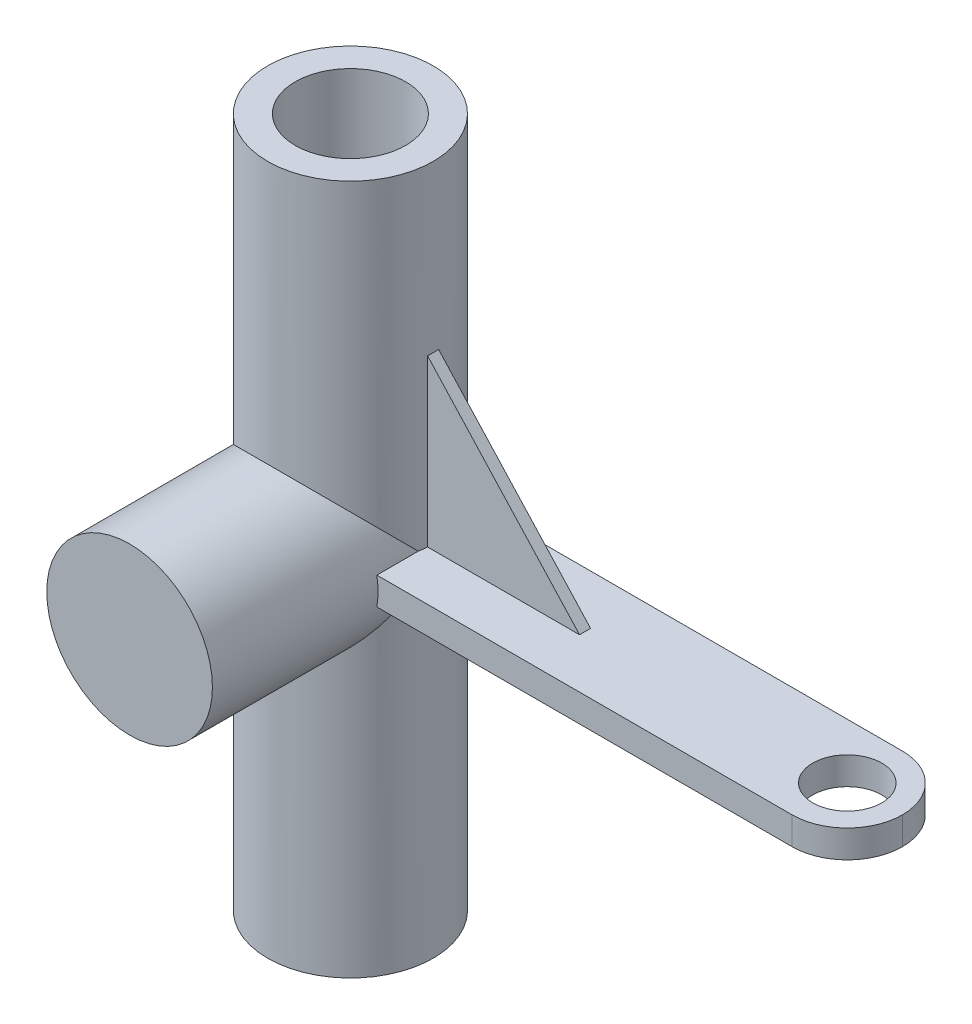
ISO-10303-21;
HEADER;
FILE_DESCRIPTION(('STEP AP214'),'2;1');
FILE_NAME('part.step','',(''),(''),'','','');
FILE_SCHEMA(('AUTOMOTIVE_DESIGN { 1 0 10303 214 1 1 1 1 }'));
ENDSEC;
DATA;
#1=APPLICATION_CONTEXT('core data for automotive mechanical design processes');
#2=APPLICATION_PROTOCOL_DEFINITION('international standard','automotive_design',2000,#1);
#3=PRODUCT_CONTEXT('',#1,'mechanical');
#4=PRODUCT('Part','Part','',(#3));
#5=PRODUCT_RELATED_PRODUCT_CATEGORY('part','',(#4));
#6=PRODUCT_DEFINITION_FORMATION('','',#4);
#7=PRODUCT_DEFINITION_CONTEXT('part definition',#1,'design');
#8=PRODUCT_DEFINITION('design','',#6,#7);
#9=PRODUCT_DEFINITION_SHAPE('','',#8);
#10=(LENGTH_UNIT() NAMED_UNIT(*) SI_UNIT(.MILLI.,.METRE.));
#11=(NAMED_UNIT(*) PLANE_ANGLE_UNIT() SI_UNIT($,.RADIAN.));
#12=(NAMED_UNIT(*) SI_UNIT($,.STERADIAN.) SOLID_ANGLE_UNIT());
#13=UNCERTAINTY_MEASURE_WITH_UNIT(LENGTH_MEASURE(1.E-05),#10,'distance_accuracy_value','');
#14=(GEOMETRIC_REPRESENTATION_CONTEXT(3) GLOBAL_UNCERTAINTY_ASSIGNED_CONTEXT((#13)) GLOBAL_UNIT_ASSIGNED_CONTEXT((#10,
#11,#12)) REPRESENTATION_CONTEXT('',''));
#15=CARTESIAN_POINT('',(0.,0.,0.));
#16=DIRECTION('',(0.,0.,1.));
#17=DIRECTION('',(1.,0.,0.));
#18=AXIS2_PLACEMENT_3D('',#15,#16,#17);
#19=CARTESIAN_POINT('',(0.,125.,0.));
#20=DIRECTION('',(0.,-1.,0.));
#21=DIRECTION('',(0.,0.,-1.));
#22=AXIS2_PLACEMENT_3D('',#19,#20,#21);
#23=CYLINDRICAL_SURFACE('',#22,15.);
#24=CARTESIAN_POINT('',(0.,0.,0.));
#25=DIRECTION('',(0.,1.,0.));
#26=DIRECTION('',(0.,0.,1.));
#27=AXIS2_PLACEMENT_3D('',#24,#25,#26);
#28=CIRCLE('',#27,15.);
#29=CARTESIAN_POINT('',(0.,0.,15.));
#30=VERTEX_POINT('',#29);
#31=EDGE_CURVE('E224',#30,#30,#28,.T.);
#32=ORIENTED_EDGE('',*,*,#31,.T.);
#33=EDGE_LOOP('',(#32));
#34=FACE_BOUND('',#33,.T.);
#35=CARTESIAN_POINT('',(0.,125.,0.));
#36=DIRECTION('',(0.,1.,0.));
#37=DIRECTION('',(0.,0.,1.));
#38=AXIS2_PLACEMENT_3D('',#35,#36,#37);
#39=CIRCLE('',#38,15.);
#40=CARTESIAN_POINT('',(0.,125.,15.));
#41=VERTEX_POINT('',#40);
#42=EDGE_CURVE('E227',#41,#41,#39,.T.);
#43=ORIENTED_EDGE('',*,*,#42,.F.);
#44=EDGE_LOOP('',(#43));
#45=FACE_BOUND('',#44,.T.);
#46=DIRECTION('',(0.,-1.,0.));
#47=VECTOR('',#46,1.);
#48=CARTESIAN_POINT('',(14.9666295470958,125.,-0.999999999999997));
#49=LINE('',#48,#47);
#50=CARTESIAN_POINT('',(14.9666295470958,65.,-0.999999999999997));
#51=VERTEX_POINT('',#50);
#52=CARTESIAN_POINT('',(14.9666295470958,95.,-0.999999999999997));
#53=VERTEX_POINT('',#52);
#54=EDGE_CURVE('E158',#51,#53,#49,.F.);
#55=ORIENTED_EDGE('',*,*,#54,.F.);
#56=CARTESIAN_POINT('',(0.,65.,0.));
#57=DIRECTION('',(0.,-1.,0.));
#58=DIRECTION('',(0.,0.,-1.));
#59=AXIS2_PLACEMENT_3D('',#56,#57,#58);
#60=CIRCLE('',#59,15.);
#61=CARTESIAN_POINT('',(11.180339887499,65.,-10.));
#62=VERTEX_POINT('',#61);
#63=EDGE_CURVE('E164',#62,#51,#60,.T.);
#64=ORIENTED_EDGE('',*,*,#63,.F.);
#65=DIRECTION('',(0.,-1.,0.));
#66=VECTOR('',#65,1.);
#67=CARTESIAN_POINT('',(11.180339887499,125.,-10.));
#68=LINE('',#67,#66);
#69=CARTESIAN_POINT('',(11.180339887499,60.,-10.));
#70=VERTEX_POINT('',#69);
#71=EDGE_CURVE('E205',#70,#62,#68,.F.);
#72=ORIENTED_EDGE('',*,*,#71,.F.);
#73=CARTESIAN_POINT('',(0.,60.,0.));
#74=DIRECTION('',(0.,1.,0.));
#75=DIRECTION('',(0.,0.,1.));
#76=AXIS2_PLACEMENT_3D('',#73,#74,#75);
#77=CIRCLE('',#76,15.);
#78=CARTESIAN_POINT('',(14.7901994577491,60.,2.5));
#79=VERTEX_POINT('',#78);
#80=EDGE_CURVE('E196',#79,#70,#77,.T.);
#81=ORIENTED_EDGE('',*,*,#80,.F.);
#82=CARTESIAN_POINT('',(0.,62.5,0.));
#83=DIRECTION('',(0.,-0.707106781186547,-0.707106781186547));
#84=DIRECTION('',(0.,-0.707106781186547,0.707106781186547));
#85=AXIS2_PLACEMENT_3D('',#82,#83,#84);
#86=ELLIPSE('',#85,21.2132034355964,15.);
#87=CARTESIAN_POINT('',(-15.,62.5,0.));
#88=VERTEX_POINT('',#87);
#89=EDGE_CURVE('E217',#88,#79,#86,.F.);
#90=ORIENTED_EDGE('',*,*,#89,.F.);
#91=CARTESIAN_POINT('',(0.,62.5,0.));
#92=DIRECTION('',(0.,-0.707106781186547,0.707106781186547));
#93=DIRECTION('',(0.,-0.707106781186547,-0.707106781186547));
#94=AXIS2_PLACEMENT_3D('',#91,#92,#93);
#95=ELLIPSE('',#94,21.2132034355964,15.);
#96=CARTESIAN_POINT('',(14.7901994577491,65.,2.5));
#97=VERTEX_POINT('',#96);
#98=EDGE_CURVE('E212',#97,#88,#95,.T.);
#99=ORIENTED_EDGE('',*,*,#98,.F.);
#100=CARTESIAN_POINT('',(14.9666295470958,65.,1.));
#101=VERTEX_POINT('',#100);
#102=EDGE_CURVE('E189',#101,#97,#60,.T.);
#103=ORIENTED_EDGE('',*,*,#102,.F.);
#104=DIRECTION('',(0.,-1.,0.));
#105=VECTOR('',#104,1.);
#106=CARTESIAN_POINT('',(14.9666295470958,125.,1.));
#107=LINE('',#106,#105);
#108=CARTESIAN_POINT('',(14.9666295470958,95.,1.));
#109=VERTEX_POINT('',#108);
#110=EDGE_CURVE('E151',#109,#101,#107,.T.);
#111=ORIENTED_EDGE('',*,*,#110,.F.);
#112=CARTESIAN_POINT('',(0.,95.,0.));
#113=DIRECTION('',(0.,-1.,0.));
#114=DIRECTION('',(0.,0.,-1.));
#115=AXIS2_PLACEMENT_3D('',#112,#113,#114);
#116=CIRCLE('',#115,15.);
#117=EDGE_CURVE('E11',#53,#109,#116,.T.);
#118=ORIENTED_EDGE('',*,*,#117,.F.);
#119=EDGE_LOOP('',(#55,#64,#72,#81,#90,#99,#103,#111,#118));
#120=FACE_BOUND('',#119,.T.);
#121=ADVANCED_FACE('F43',(#34,#45,#120),#23,.T.);
#122=CARTESIAN_POINT('',(100.,65.,10.));
#123=DIRECTION('',(0.,-1.,0.));
#124=DIRECTION('',(0.,0.,-1.));
#125=AXIS2_PLACEMENT_3D('',#122,#123,#124);
#126=PLANE('',#125);
#127=CARTESIAN_POINT('',(90.,65.,0.));
#128=DIRECTION('',(0.,1.,0.));
#129=DIRECTION('',(0.,0.,1.));
#130=AXIS2_PLACEMENT_3D('',#127,#128,#129);
#131=CIRCLE('',#130,6.25);
#132=CARTESIAN_POINT('',(90.,65.,6.25));
#133=VERTEX_POINT('',#132);
#134=EDGE_CURVE('E580',#133,#133,#131,.T.);
#135=ORIENTED_EDGE('',*,*,#134,.F.);
#136=EDGE_LOOP('',(#135));
#137=FACE_BOUND('',#136,.T.);
#138=DIRECTION('',(0.,0.,-1.));
#139=VECTOR('',#138,1.);
#140=CARTESIAN_POINT('',(42.5,65.,-0.999999999999997));
#141=LINE('',#140,#139);
#142=CARTESIAN_POINT('',(42.5,65.,1.));
#143=VERTEX_POINT('',#142);
#144=CARTESIAN_POINT('',(42.5,65.,-0.999999999999997));
#145=VERTEX_POINT('',#144);
#146=EDGE_CURVE('E145',#143,#145,#141,.T.);
#147=ORIENTED_EDGE('',*,*,#146,.F.);
#148=DIRECTION('',(1.,0.,0.));
#149=VECTOR('',#148,1.);
#150=CARTESIAN_POINT('',(100.,65.,1.));
#151=LINE('',#150,#149);
#152=EDGE_CURVE('E52',#101,#143,#151,.T.);
#153=ORIENTED_EDGE('',*,*,#152,.F.);
#154=ORIENTED_EDGE('',*,*,#102,.T.);
#155=DIRECTION('',(0.,0.,-1.));
#156=VECTOR('',#155,1.);
#157=CARTESIAN_POINT('',(14.7901994577491,65.,40.));
#158=LINE('',#157,#156);
#159=CARTESIAN_POINT('',(14.7901994577491,65.,10.));
#160=VERTEX_POINT('',#159);
#161=EDGE_CURVE('E355',#97,#160,#158,.F.);
#162=ORIENTED_EDGE('',*,*,#161,.T.);
#163=DIRECTION('',(-1.,0.,0.));
#164=VECTOR('',#163,1.);
#165=CARTESIAN_POINT('',(100.,65.,10.));
#166=LINE('',#165,#164);
#167=CARTESIAN_POINT('',(90.,65.,10.));
#168=VERTEX_POINT('',#167);
#169=EDGE_CURVE('E181',#168,#160,#166,.T.);
#170=ORIENTED_EDGE('',*,*,#169,.F.);
#171=CARTESIAN_POINT('',(90.,65.,0.));
#172=DIRECTION('',(0.,-1.,0.));
#173=DIRECTION('',(0.,0.,-1.));
#174=AXIS2_PLACEMENT_3D('',#171,#172,#173);
#175=CIRCLE('',#174,10.);
#176=CARTESIAN_POINT('',(100.,65.,0.));
#177=VERTEX_POINT('',#176);
#178=EDGE_CURVE('E363',#168,#177,#175,.F.);
#179=ORIENTED_EDGE('',*,*,#178,.T.);
#180=CARTESIAN_POINT('',(90.,65.,0.));
#181=DIRECTION('',(0.,-1.,0.));
#182=DIRECTION('',(0.,0.,-1.));
#183=AXIS2_PLACEMENT_3D('',#180,#181,#182);
#184=CIRCLE('',#183,10.);
#185=CARTESIAN_POINT('',(90.,65.,-10.));
#186=VERTEX_POINT('',#185);
#187=EDGE_CURVE('E342',#177,#186,#184,.F.);
#188=ORIENTED_EDGE('',*,*,#187,.T.);
#189=DIRECTION('',(-1.,0.,0.));
#190=VECTOR('',#189,1.);
#191=CARTESIAN_POINT('',(100.,65.,-10.));
#192=LINE('',#191,#190);
#193=EDGE_CURVE('E183',#186,#62,#192,.T.);
#194=ORIENTED_EDGE('',*,*,#193,.T.);
#195=ORIENTED_EDGE('',*,*,#63,.T.);
#196=DIRECTION('',(-1.,0.,0.));
#197=VECTOR('',#196,1.);
#198=CARTESIAN_POINT('',(14.5,65.,-0.999999999999997));
#199=LINE('',#198,#197);
#200=EDGE_CURVE('E152',#145,#51,#199,.T.);
#201=ORIENTED_EDGE('',*,*,#200,.F.);
#202=EDGE_LOOP('',(#147,#153,#154,#162,#170,#179,#188,#194,#195,#201));
#203=FACE_BOUND('',#202,.T.);
#204=ADVANCED_FACE('F162',(#137,#203),#126,.F.);
#205=CARTESIAN_POINT('',(0.,125.,0.));
#206=DIRECTION('',(0.,-1.,0.));
#207=DIRECTION('',(0.,0.,-1.));
#208=AXIS2_PLACEMENT_3D('',#205,#206,#207);
#209=CYLINDRICAL_SURFACE('',#208,10.);
#210=CARTESIAN_POINT('',(0.,125.,0.));
#211=DIRECTION('',(0.,1.,0.));
#212=DIRECTION('',(0.,0.,1.));
#213=AXIS2_PLACEMENT_3D('',#210,#211,#212);
#214=CIRCLE('',#213,10.);
#215=CARTESIAN_POINT('',(0.,125.,10.));
#216=VERTEX_POINT('',#215);
#217=EDGE_CURVE('E221',#216,#216,#214,.T.);
#218=ORIENTED_EDGE('',*,*,#217,.T.);
#219=EDGE_LOOP('',(#218));
#220=FACE_BOUND('',#219,.T.);
#221=CARTESIAN_POINT('',(0.,0.,0.));
#222=DIRECTION('',(0.,1.,0.));
#223=DIRECTION('',(0.,0.,1.));
#224=AXIS2_PLACEMENT_3D('',#221,#222,#223);
#225=CIRCLE('',#224,10.);
#226=CARTESIAN_POINT('',(0.,0.,10.));
#227=VERTEX_POINT('',#226);
#228=EDGE_CURVE('E220',#227,#227,#225,.T.);
#229=ORIENTED_EDGE('',*,*,#228,.F.);
#230=EDGE_LOOP('',(#229));
#231=FACE_BOUND('',#230,.T.);
#232=DIRECTION('',(0.,-1.,0.));
#233=VECTOR('',#232,1.);
#234=CARTESIAN_POINT('',(10.,125.,0.));
#235=LINE('',#234,#233);
#236=CARTESIAN_POINT('',(10.,51.319660112501,0.));
#237=VERTEX_POINT('',#236);
#238=CARTESIAN_POINT('',(10.,60.,0.));
#239=VERTEX_POINT('',#238);
#240=EDGE_CURVE('E233',#237,#239,#235,.F.);
#241=ORIENTED_EDGE('',*,*,#240,.T.);
#242=CARTESIAN_POINT('',(0.,60.,0.));
#243=DIRECTION('',(0.,1.,0.));
#244=DIRECTION('',(0.,0.,1.));
#245=AXIS2_PLACEMENT_3D('',#242,#243,#244);
#246=CIRCLE('',#245,10.);
#247=CARTESIAN_POINT('',(0.,60.,-10.));
#248=VERTEX_POINT('',#247);
#249=EDGE_CURVE('E202',#239,#248,#246,.T.);
#250=ORIENTED_EDGE('',*,*,#249,.T.);
#251=DIRECTION('',(0.,1.,0.));
#252=VECTOR('',#251,1.);
#253=CARTESIAN_POINT('',(0.,65.,-10.));
#254=LINE('',#253,#252);
#255=CARTESIAN_POINT('',(0.,65.,-10.));
#256=VERTEX_POINT('',#255);
#257=EDGE_CURVE('E175',#248,#256,#254,.T.);
#258=ORIENTED_EDGE('',*,*,#257,.T.);
#259=CARTESIAN_POINT('',(0.,65.,0.));
#260=DIRECTION('',(0.,-1.,0.));
#261=DIRECTION('',(0.,0.,-1.));
#262=AXIS2_PLACEMENT_3D('',#259,#260,#261);
#263=CIRCLE('',#262,10.);
#264=CARTESIAN_POINT('',(10.,65.,0.));
#265=VERTEX_POINT('',#264);
#266=EDGE_CURVE('E193',#256,#265,#263,.T.);
#267=ORIENTED_EDGE('',*,*,#266,.T.);
#268=CARTESIAN_POINT('',(10.,73.680339887499,0.));
#269=VERTEX_POINT('',#268);
#270=EDGE_CURVE('E230',#265,#269,#235,.F.);
#271=ORIENTED_EDGE('',*,*,#270,.T.);
#272=CARTESIAN_POINT('',(10.,73.680339887499,0.));
#273=CARTESIAN_POINT('',(10.0000019662644,73.6803341285554,0.122908083291886));
#274=CARTESIAN_POINT('',(9.99773339672962,73.6823676522141,0.245795438662537));
#275=CARTESIAN_POINT('',(9.98868075195431,73.6904562528802,0.491259157771999));
#276=CARTESIAN_POINT('',(9.98189712810506,73.696510927874,0.613835551369558));
#277=CARTESIAN_POINT('',(9.95484008556213,73.7205962021832,0.980341470499923));
#278=CARTESIAN_POINT('',(9.92786031801123,73.7445484143372,1.22344075436707));
#279=CARTESIAN_POINT('',(9.85692199140147,73.8067794801167,1.70271606910721));
#280=CARTESIAN_POINT('',(9.81313360307206,73.8449146287484,1.93893674586963));
#281=CARTESIAN_POINT('',(9.70933595979469,73.9338733583765,2.40539084014844));
#282=CARTESIAN_POINT('',(9.64932198669643,73.9847006297179,2.63562249476913));
#283=CARTESIAN_POINT('',(9.51430209888207,74.0967965567622,3.08762076307501));
#284=CARTESIAN_POINT('',(9.43937638209315,74.1580091094161,3.30942540898784));
#285=CARTESIAN_POINT('',(9.27521238204891,74.2890411827064,3.7449468087664));
#286=CARTESIAN_POINT('',(9.18597482688439,74.3588602654582,3.95866397338595));
#287=CARTESIAN_POINT('',(8.89735329466268,74.5787194524851,4.58807557587278));
#288=CARTESIAN_POINT('',(8.67735629737759,74.7389043780612,4.99105544505011));
#289=CARTESIAN_POINT('',(8.29129524792107,75.0013515100962,5.5967548522808));
#290=CARTESIAN_POINT('',(8.1417020470214,75.0994998696131,5.81216410863114));
#291=CARTESIAN_POINT('',(7.82649231833529,75.2976804602117,6.23012673255034));
#292=CARTESIAN_POINT('',(7.66087472678606,75.397712816005,6.43267924515728));
#293=CARTESIAN_POINT('',(7.31418209262196,75.5974342938179,6.82430658353011));
#294=CARTESIAN_POINT('',(7.13310489225783,75.6971233658976,7.01337952112643));
#295=CARTESIAN_POINT('',(6.75590366095745,75.8941428962359,7.37743148512814));
#296=CARTESIAN_POINT('',(6.55977230733853,75.9914721759597,7.55240356663883));
#297=CARTESIAN_POINT('',(6.12350040303769,76.1955771283599,7.91162090637637));
#298=CARTESIAN_POINT('',(5.88110397785951,76.3016735607452,8.09352620425259));
#299=CARTESIAN_POINT('',(5.37841190890662,76.5052195059547,8.43594148342966));
#300=CARTESIAN_POINT('',(5.11812584836926,76.6026735852692,8.59646278650464));
#301=CARTESIAN_POINT('',(4.58092530474232,76.7862046380633,8.89434642230069));
#302=CARTESIAN_POINT('',(4.30401783641956,76.8722863626223,9.03171843285677));
#303=CARTESIAN_POINT('',(3.73529722016773,77.0304715239106,9.28137561061249));
#304=CARTESIAN_POINT('',(3.44348728334321,77.1025779560387,9.39366615444473));
#305=CARTESIAN_POINT('',(2.88082821284893,77.223250182534,9.58011233592227));
#306=CARTESIAN_POINT('',(2.61129919972898,77.2735492311711,9.65713262962674));
#307=CARTESIAN_POINT('',(2.0645294229625,77.3598209230397,9.78860280762323));
#308=CARTESIAN_POINT('',(1.78728918107016,77.3957945330429,9.84305421501748));
#309=CARTESIAN_POINT('',(1.22793917300902,77.4522941504247,9.92834932789231));
#310=CARTESIAN_POINT('',(0.945834860668397,77.4728364372598,9.95921791293619));
#311=CARTESIAN_POINT('',(0.379327505846204,77.4978816841611,9.99683241551685));
#312=CARTESIAN_POINT('',(0.0949247933797898,77.50238690729,10.0035817366327));
#313=CARTESIAN_POINT('',(-0.429890333129019,77.4957738621773,9.99365946293529));
#314=CARTESIAN_POINT('',(-0.670405430373815,77.4869306305415,9.98039843933322));
#315=CARTESIAN_POINT('',(-1.14916934748078,77.4578376542313,9.93665826160711));
#316=CARTESIAN_POINT('',(-1.38741821686984,77.4375881594182,9.90617948464865));
#317=CARTESIAN_POINT('',(-1.8599416134959,77.3861382030705,9.82842601275427));
#318=CARTESIAN_POINT('',(-2.09421618238097,77.3549378563681,9.78115149394085));
#319=CARTESIAN_POINT('',(-2.55727839003123,77.2822617118014,9.67041909157562));
#320=CARTESIAN_POINT('',(-2.78606579121632,77.2407854698954,9.60696050867491));
#321=CARTESIAN_POINT('',(-3.23586004110859,77.1486073470994,9.46491433929526));
#322=CARTESIAN_POINT('',(-3.45689579211393,77.0979453708846,9.38639210985778));
#323=CARTESIAN_POINT('',(-3.89118343175868,76.9882323039131,9.21483719709088));
#324=CARTESIAN_POINT('',(-4.1044327303078,76.9291784530634,9.1217997387039));
#325=CARTESIAN_POINT('',(-4.52213359273533,76.8037704642793,8.9221009894455));
#326=CARTESIAN_POINT('',(-4.72658750024245,76.7374182880364,8.81544335825792));
#327=CARTESIAN_POINT('',(-5.12613026843352,76.598494483268,8.58926728521921));
#328=CARTESIAN_POINT('',(-5.32121574797326,76.5259206352202,8.46974424983818));
#329=CARTESIAN_POINT('',(-5.72633078565189,76.3658779971488,8.20216646387367));
#330=CARTESIAN_POINT('',(-5.93496872233939,76.2777035729189,8.05242530391318));
#331=CARTESIAN_POINT('',(-6.33894603460613,76.0965729756602,7.73842700250566));
#332=CARTESIAN_POINT('',(-6.53427941602822,76.0036146800134,7.57416339378907));
#333=CARTESIAN_POINT('',(-6.91132960510199,75.8145806026907,7.23176778878176));
#334=CARTESIAN_POINT('',(-7.09302687376191,75.7185006199906,7.05361661073946));
#335=CARTESIAN_POINT('',(-7.44198959608793,75.5252280827419,6.68440712720149));
#336=CARTESIAN_POINT('',(-7.60925973806327,75.4280359013365,6.49335305095354));
#337=CARTESIAN_POINT('',(-7.95384735185595,75.2193915728319,6.06814596506085));
#338=CARTESIAN_POINT('',(-8.12868447910812,75.1080713984021,5.83191005670115));
#339=CARTESIAN_POINT('',(-8.45775206098623,74.8897309634299,5.34351489749032));
#340=CARTESIAN_POINT('',(-8.61197769657105,74.7827117125346,5.09135194306177));
#341=CARTESIAN_POINT('',(-8.89853128768456,74.5767233207896,4.57208818968848));
#342=CARTESIAN_POINT('',(-9.03088152717082,74.477746040699,4.30500296758524));
#343=CARTESIAN_POINT('',(-9.27240645990513,74.2917648681875,3.75661281001167));
#344=CARTESIAN_POINT('',(-9.38159284001154,74.2047549457079,3.47531513427528));
#345=CARTESIAN_POINT('',(-9.54801158638537,74.0690778214802,2.9804793272992));
#346=CARTESIAN_POINT('',(-9.61123177037526,74.0164952118853,2.770013403874));
#347=CARTESIAN_POINT('',(-9.72408164930214,73.9213698799914,2.34326880833405));
#348=CARTESIAN_POINT('',(-9.77371524585155,73.878824275887,2.12699182459367));
#349=CARTESIAN_POINT('',(-9.85861049231009,73.8053505181962,1.69030911284007));
#350=CARTESIAN_POINT('',(-9.89391085780338,73.7743910871009,1.46991621176618));
#351=CARTESIAN_POINT('',(-9.94974461286417,73.7251497436318,1.02594789295992));
#352=CARTESIAN_POINT('',(-9.97028723032151,73.7068599093269,0.802374553285027));
#353=CARTESIAN_POINT('',(-9.98884716882532,73.6903071254827,0.481904573199954));
#354=CARTESIAN_POINT('',(-9.99302852832223,73.6865722173172,0.385592968518363));
#355=CARTESIAN_POINT('',(-9.99860456831422,73.6815883268953,0.192858527287807));
#356=CARTESIAN_POINT('',(-10.0000002177439,73.6803384802772,0.0964357410905486));
#357=CARTESIAN_POINT('',(-10.,73.6803398874989,0.));
#358=B_SPLINE_CURVE_WITH_KNOTS('',3,(#272,#273,#274,#275,#276,#277,#278,#279,#280,#281,#282,
#283,#284,#285,#286,#287,#288,#289,#290,#291,#292,#293,#294,#295,#296,#297,#298,#299,#300,#301,
#302,#303,#304,#305,#306,#307,#308,#309,#310,#311,#312,#313,#314,#315,#316,#317,#318,#319,#320,
#321,#322,#323,#324,#325,#326,#327,#328,#329,#330,#331,#332,#333,#334,#335,#336,#337,#338,#339,
#340,#341,#342,#343,#344,#345,#346,#347,#348,#349,#350,#351,#352,#353,#354,#355,#356,#357),
.UNSPECIFIED.,.F.,.F.,(4,2,2,2,2,2,2,2,2,2,2,2,2,2,2,2,2,2,2,2,2,2,2,2,2,2,2,2,2,2,2,2,2,2,2,2,
2,2,2,2,2,2,4),(0.,0.368646050186405,0.737255250621696,1.47329974643748,2.20208108990007,
2.93107458010895,3.65624850314492,4.38138554586728,5.83478174144707,6.6742647519412,
7.51380352894201,8.35345967533995,9.19352686995975,10.1555208892916,11.1170035384646,
12.0780832258629,13.0389566915795,13.8920552544146,14.745096234968,15.5972360211362,
16.4492555532334,17.1715077978443,17.8937442216846,18.6159730722762,19.3382331372499,
20.0574276279281,20.7768592119827,21.4960978929086,22.2155942317108,23.0293731080495,
23.8435162270739,24.658804488051,25.4738268028542,26.4155476148543,27.3574882208219,
28.2984632997486,29.2389624936457,29.9162147428955,30.5932723034906,31.2684886948951,
31.9432825110777,32.2326465857274,32.5219099952884),.UNSPECIFIED.);
#359=CARTESIAN_POINT('',(-10.,73.6803398874989,0.));
#360=VERTEX_POINT('',#359);
#361=EDGE_CURVE('E245',#269,#360,#358,.T.);
#362=ORIENTED_EDGE('',*,*,#361,.T.);
#363=DIRECTION('',(0.,-1.,0.));
#364=VECTOR('',#363,1.);
#365=CARTESIAN_POINT('',(-10.,125.,0.));
#366=LINE('',#365,#364);
#367=CARTESIAN_POINT('',(-10.,51.3196601125011,0.));
#368=VERTEX_POINT('',#367);
#369=EDGE_CURVE('E371',#360,#368,#366,.T.);
#370=ORIENTED_EDGE('',*,*,#369,.T.);
#371=CARTESIAN_POINT('',(-10.,51.3196601125011,0.));
#372=CARTESIAN_POINT('',(-10.0000019662644,51.3196658714447,0.122908083291886));
#373=CARTESIAN_POINT('',(-9.99773339672962,51.317632347786,0.245795438662537));
#374=CARTESIAN_POINT('',(-9.98868075195431,51.3095437471198,0.491259157771998));
#375=CARTESIAN_POINT('',(-9.98189712810506,51.303489072126,0.613835551369557));
#376=CARTESIAN_POINT('',(-9.95484008556213,51.2794037978168,0.980341470499922));
#377=CARTESIAN_POINT('',(-9.92786031801124,51.2554515856628,1.22344075436707));
#378=CARTESIAN_POINT('',(-9.85692199140147,51.1932205198833,1.70271606910721));
#379=CARTESIAN_POINT('',(-9.81313360307206,51.1550853712516,1.93893674586963));
#380=CARTESIAN_POINT('',(-9.70933595979468,51.0661266416235,2.40539084014844));
#381=CARTESIAN_POINT('',(-9.64932198669643,51.0152993702822,2.63562249476913));
#382=CARTESIAN_POINT('',(-9.51430209888207,50.9032034432379,3.087620763075));
#383=CARTESIAN_POINT('',(-9.43937638209315,50.8419908905839,3.30942540898784));
#384=CARTESIAN_POINT('',(-9.27521238204891,50.7109588172936,3.74494680876639));
#385=CARTESIAN_POINT('',(-9.18597482688439,50.6411397345419,3.95866397338595));
#386=CARTESIAN_POINT('',(-8.89735329466268,50.4212805475149,4.58807557587278));
#387=CARTESIAN_POINT('',(-8.67735629737759,50.2610956219389,4.9910554450501));
#388=CARTESIAN_POINT('',(-8.29129524792108,49.9986484899039,5.59675485228079));
#389=CARTESIAN_POINT('',(-8.14170204702141,49.9005001303869,5.81216410863114));
#390=CARTESIAN_POINT('',(-7.8264923183353,49.7023195397884,6.23012673255034));
#391=CARTESIAN_POINT('',(-7.66087472678607,49.6022871839951,6.43267924515728));
#392=CARTESIAN_POINT('',(-7.31418209262197,49.4025657061821,6.8243065835301));
#393=CARTESIAN_POINT('',(-7.13310489225784,49.3028766341024,7.01337952112642));
#394=CARTESIAN_POINT('',(-6.75590366095745,49.1058571037641,7.37743148512813));
#395=CARTESIAN_POINT('',(-6.55977230733853,49.0085278240403,7.55240356663882));
#396=CARTESIAN_POINT('',(-6.1235004030377,48.8044228716401,7.91162090637637));
#397=CARTESIAN_POINT('',(-5.88110397785953,48.6983264392548,8.09352620425258));
#398=CARTESIAN_POINT('',(-5.37841190890663,48.4947804940454,8.43594148342965));
#399=CARTESIAN_POINT('',(-5.11812584836927,48.3973264147308,8.59646278650463));
#400=CARTESIAN_POINT('',(-4.58092530474233,48.2137953619367,8.89434642230069));
#401=CARTESIAN_POINT('',(-4.30401783641957,48.1277136373777,9.03171843285677));
#402=CARTESIAN_POINT('',(-3.73529722016774,47.9695284760894,9.28137561061249));
#403=CARTESIAN_POINT('',(-3.44348728334322,47.8974220439613,9.39366615444472));
#404=CARTESIAN_POINT('',(-2.88082821284894,47.776749817466,9.58011233592226));
#405=CARTESIAN_POINT('',(-2.61129919972899,47.7264507688289,9.65713262962674));
#406=CARTESIAN_POINT('',(-2.06452942296251,47.6401790769603,9.78860280762323));
#407=CARTESIAN_POINT('',(-1.78728918107017,47.6042054669571,9.84305421501748));
#408=CARTESIAN_POINT('',(-1.22793917300903,47.5477058495753,9.9283493278923));
#409=CARTESIAN_POINT('',(-0.945834860668403,47.5271635627402,9.95921791293619));
#410=CARTESIAN_POINT('',(-0.379327505846209,47.5021183158389,9.99683241551685));
#411=CARTESIAN_POINT('',(-0.0949247933797949,47.49761309271,10.0035817366327));
#412=CARTESIAN_POINT('',(0.429890333129016,47.5042261378227,9.99365946293529));
#413=CARTESIAN_POINT('',(0.670405430373814,47.5130693694585,9.98039843933322));
#414=CARTESIAN_POINT('',(1.14916934748078,47.5421623457687,9.93665826160711));
#415=CARTESIAN_POINT('',(1.38741821686984,47.5624118405818,9.90617948464865));
#416=CARTESIAN_POINT('',(1.8599416134959,47.6138617969295,9.82842601275427));
#417=CARTESIAN_POINT('',(2.09421618238097,47.6450621436319,9.78115149394085));
#418=CARTESIAN_POINT('',(2.55727839003123,47.7177382881986,9.67041909157562));
#419=CARTESIAN_POINT('',(2.78606579121632,47.7592145301046,9.60696050867492));
#420=CARTESIAN_POINT('',(3.23586004110859,47.8513926529006,9.46491433929526));
#421=CARTESIAN_POINT('',(3.45689579211392,47.9020546291154,9.38639210985778));
#422=CARTESIAN_POINT('',(3.89118343175868,48.0117676960869,9.21483719709089));
#423=CARTESIAN_POINT('',(4.10443273030779,48.0708215469366,9.1217997387039));
#424=CARTESIAN_POINT('',(4.52213359273532,48.1962295357207,8.9221009894455));
#425=CARTESIAN_POINT('',(4.72658750024244,48.2625817119636,8.81544335825793));
#426=CARTESIAN_POINT('',(5.12613026843351,48.4015055167319,8.58926728521922));
#427=CARTESIAN_POINT('',(5.32121574797326,48.4740793647797,8.46974424983818));
#428=CARTESIAN_POINT('',(5.72633078565189,48.6341220028511,8.20216646387367));
#429=CARTESIAN_POINT('',(5.93496872233939,48.7222964270811,8.05242530391319));
#430=CARTESIAN_POINT('',(6.33894603460612,48.9034270243398,7.73842700250566));
#431=CARTESIAN_POINT('',(6.53427941602821,48.9963853199866,7.57416339378907));
#432=CARTESIAN_POINT('',(6.91132960510199,49.1854193973092,7.23176778878176));
#433=CARTESIAN_POINT('',(7.09302687376191,49.2814993800093,7.05361661073946));
#434=CARTESIAN_POINT('',(7.44198959608793,49.4747719172581,6.68440712720149));
#435=CARTESIAN_POINT('',(7.60925973806327,49.5719640986635,6.49335305095354));
#436=CARTESIAN_POINT('',(7.95384735185595,49.7806084271681,6.06814596506086));
#437=CARTESIAN_POINT('',(8.12868447910812,49.8919286015979,5.83191005670115));
#438=CARTESIAN_POINT('',(8.45775206098623,50.1102690365701,5.34351489749032));
#439=CARTESIAN_POINT('',(8.61197769657104,50.2172882874654,5.09135194306177));
#440=CARTESIAN_POINT('',(8.89853128768456,50.4232766792103,4.57208818968848));
#441=CARTESIAN_POINT('',(9.03088152717082,50.5222539593009,4.30500296758524));
#442=CARTESIAN_POINT('',(9.27240645990512,50.7082351318125,3.75661281001168));
#443=CARTESIAN_POINT('',(9.38159284001154,50.7952450542921,3.47531513427529));
#444=CARTESIAN_POINT('',(9.54801158638536,50.9309221785198,2.9804793272992));
#445=CARTESIAN_POINT('',(9.61123177037526,50.9835047881147,2.770013403874));
#446=CARTESIAN_POINT('',(9.72408164930214,51.0786301200085,2.34326880833406));
#447=CARTESIAN_POINT('',(9.77371524585155,51.121175724113,2.12699182459367));
#448=CARTESIAN_POINT('',(9.85861049231008,51.1946494818038,1.69030911284007));
#449=CARTESIAN_POINT('',(9.89391085780338,51.2256089128991,1.46991621176618));
#450=CARTESIAN_POINT('',(9.94974461286417,51.2748502563682,1.02594789295992));
#451=CARTESIAN_POINT('',(9.97028723032151,51.2931400906731,0.802374553285026));
#452=CARTESIAN_POINT('',(9.98884716882532,51.3096928745173,0.481904573199954));
#453=CARTESIAN_POINT('',(9.99302852832223,51.3134277826827,0.385592968518363));
#454=CARTESIAN_POINT('',(9.99860456831422,51.3184116731047,0.192858527287807));
#455=CARTESIAN_POINT('',(10.0000002177439,51.3196615197227,0.0964357410905487));
#456=CARTESIAN_POINT('',(10.,51.319660112501,0.));
#457=B_SPLINE_CURVE_WITH_KNOTS('',3,(#371,#372,#373,#374,#375,#376,#377,#378,#379,#380,#381,
#382,#383,#384,#385,#386,#387,#388,#389,#390,#391,#392,#393,#394,#395,#396,#397,#398,#399,#400,
#401,#402,#403,#404,#405,#406,#407,#408,#409,#410,#411,#412,#413,#414,#415,#416,#417,#418,#419,
#420,#421,#422,#423,#424,#425,#426,#427,#428,#429,#430,#431,#432,#433,#434,#435,#436,#437,#438,
#439,#440,#441,#442,#443,#444,#445,#446,#447,#448,#449,#450,#451,#452,#453,#454,#455,#456),
.UNSPECIFIED.,.F.,.F.,(4,2,2,2,2,2,2,2,2,2,2,2,2,2,2,2,2,2,2,2,2,2,2,2,2,2,2,2,2,2,2,2,2,2,2,2,
2,2,2,2,2,2,4),(0.,0.368646050186405,0.737255250621695,1.47329974643748,2.20208108990007,
2.93107458010894,3.65624850314492,4.38138554586728,5.83478174144706,6.6742647519412,
7.51380352894201,8.35345967533995,9.19352686995974,10.1555208892916,11.1170035384646,
12.0780832258629,13.0389566915795,13.8920552544146,14.745096234968,15.5972360211362,
16.4492555532334,17.1715077978443,17.8937442216846,18.6159730722762,19.3382331372499,
20.0574276279282,20.7768592119827,21.4960978929086,22.2155942317108,23.0293731080495,
23.8435162270739,24.658804488051,25.4738268028542,26.4155476148543,27.3574882208219,
28.2984632997486,29.2389624936457,29.9162147428955,30.5932723034906,31.2684886948951,
31.9432825110777,32.2326465857274,32.5219099952884),.UNSPECIFIED.);
#458=EDGE_CURVE('E236',#368,#237,#457,.T.);
#459=ORIENTED_EDGE('',*,*,#458,.T.);
#460=EDGE_LOOP('',(#241,#250,#258,#267,#271,#362,#370,#459));
#461=FACE_BOUND('',#460,.T.);
#462=ADVANCED_FACE('F251',(#220,#231,#461),#209,.F.);
#463=CARTESIAN_POINT('',(0.,62.5,0.));
#464=DIRECTION('',(0.,0.,1.));
#465=DIRECTION('',(1.,0.,0.));
#466=AXIS2_PLACEMENT_3D('',#463,#464,#465);
#467=PLANE('',#466);
#468=DIRECTION('',(-1.,0.,0.));
#469=VECTOR('',#468,1.);
#470=CARTESIAN_POINT('',(0.,60.,0.));
#471=LINE('',#470,#469);
#472=CARTESIAN_POINT('',(0.,60.,0.));
#473=VERTEX_POINT('',#472);
#474=EDGE_CURVE('E199',#239,#473,#471,.T.);
#475=ORIENTED_EDGE('',*,*,#474,.F.);
#476=ORIENTED_EDGE('',*,*,#240,.F.);
#477=CARTESIAN_POINT('',(0.,62.5,0.));
#478=DIRECTION('',(0.,0.,1.));
#479=DIRECTION('',(1.,0.,0.));
#480=AXIS2_PLACEMENT_3D('',#477,#478,#479);
#481=CIRCLE('',#480,15.);
#482=EDGE_CURVE('E208',#368,#237,#481,.T.);
#483=ORIENTED_EDGE('',*,*,#482,.F.);
#484=ORIENTED_EDGE('',*,*,#369,.F.);
#485=EDGE_CURVE('E213',#269,#360,#481,.T.);
#486=ORIENTED_EDGE('',*,*,#485,.F.);
#487=ORIENTED_EDGE('',*,*,#270,.F.);
#488=DIRECTION('',(1.,0.,0.));
#489=VECTOR('',#488,1.);
#490=CARTESIAN_POINT('',(0.,65.,0.));
#491=LINE('',#490,#489);
#492=CARTESIAN_POINT('',(0.,65.,0.));
#493=VERTEX_POINT('',#492);
#494=EDGE_CURVE('E191',#493,#265,#491,.T.);
#495=ORIENTED_EDGE('',*,*,#494,.F.);
#496=DIRECTION('',(0.,-1.,0.));
#497=VECTOR('',#496,1.);
#498=CARTESIAN_POINT('',(0.,62.5,0.));
#499=LINE('',#498,#497);
#500=EDGE_CURVE('E365',#493,#473,#499,.T.);
#501=ORIENTED_EDGE('',*,*,#500,.T.);
#502=EDGE_LOOP('',(#475,#476,#483,#484,#486,#487,#495,#501));
#503=FACE_BOUND('',#502,.T.);
#504=ADVANCED_FACE('F262',(#503),#467,.F.);
#505=CARTESIAN_POINT('',(0.,62.5,40.));
#506=DIRECTION('',(0.,0.,-1.));
#507=DIRECTION('',(-1.,0.,0.));
#508=AXIS2_PLACEMENT_3D('',#505,#506,#507);
#509=CYLINDRICAL_SURFACE('',#508,15.);
#510=CARTESIAN_POINT('',(0.,62.5,40.));
#511=DIRECTION('',(0.,0.,1.));
#512=DIRECTION('',(1.,0.,0.));
#513=AXIS2_PLACEMENT_3D('',#510,#511,#512);
#514=CIRCLE('',#513,15.);
#515=CARTESIAN_POINT('',(15.,62.5,40.));
#516=VERTEX_POINT('',#515);
#517=EDGE_CURVE('E209',#516,#516,#514,.T.);
#518=ORIENTED_EDGE('',*,*,#517,.F.);
#519=EDGE_LOOP('',(#518));
#520=FACE_BOUND('',#519,.T.);
#521=DIRECTION('',(0.,0.,-1.));
#522=VECTOR('',#521,1.);
#523=CARTESIAN_POINT('',(14.7901994577491,60.,40.));
#524=LINE('',#523,#522);
#525=CARTESIAN_POINT('',(14.7901994577491,60.,10.));
#526=VERTEX_POINT('',#525);
#527=EDGE_CURVE('E346',#526,#79,#524,.T.);
#528=ORIENTED_EDGE('',*,*,#527,.F.);
#529=CARTESIAN_POINT('',(0.,62.5,10.));
#530=DIRECTION('',(0.,0.,-1.));
#531=DIRECTION('',(-1.,0.,0.));
#532=AXIS2_PLACEMENT_3D('',#529,#530,#531);
#533=CIRCLE('',#532,15.);
#534=EDGE_CURVE('E369',#160,#526,#533,.T.);
#535=ORIENTED_EDGE('',*,*,#534,.F.);
#536=ORIENTED_EDGE('',*,*,#161,.F.);
#537=ORIENTED_EDGE('',*,*,#98,.T.);
#538=ORIENTED_EDGE('',*,*,#89,.T.);
#539=EDGE_LOOP('',(#528,#535,#536,#537,#538));
#540=FACE_BOUND('',#539,.T.);
#541=ADVANCED_FACE('F261',(#520,#540),#509,.T.);
#542=CARTESIAN_POINT('',(0.,125.,0.));
#543=DIRECTION('',(0.,1.,0.));
#544=DIRECTION('',(0.,0.,1.));
#545=AXIS2_PLACEMENT_3D('',#542,#543,#544);
#546=PLANE('',#545);
#547=ORIENTED_EDGE('',*,*,#42,.T.);
#548=EDGE_LOOP('',(#547));
#549=FACE_BOUND('',#548,.T.);
#550=ORIENTED_EDGE('',*,*,#217,.F.);
#551=EDGE_LOOP('',(#550));
#552=FACE_BOUND('',#551,.T.);
#553=ADVANCED_FACE('F389',(#549,#552),#546,.T.);
#554=CARTESIAN_POINT('',(0.,0.,0.));
#555=DIRECTION('',(0.,1.,0.));
#556=DIRECTION('',(0.,0.,1.));
#557=AXIS2_PLACEMENT_3D('',#554,#555,#556);
#558=PLANE('',#557);
#559=ORIENTED_EDGE('',*,*,#31,.F.);
#560=EDGE_LOOP('',(#559));
#561=FACE_BOUND('',#560,.T.);
#562=ORIENTED_EDGE('',*,*,#228,.T.);
#563=EDGE_LOOP('',(#562));
#564=FACE_BOUND('',#563,.T.);
#565=ADVANCED_FACE('F259',(#561,#564),#558,.F.);
#566=ORIENTED_EDGE('',*,*,#458,.F.);
#567=ORIENTED_EDGE('',*,*,#482,.T.);
#568=EDGE_LOOP('',(#566,#567));
#569=FACE_BOUND('',#568,.T.);
#570=ADVANCED_FACE('F254',(#569),#509,.T.);
#571=ORIENTED_EDGE('',*,*,#361,.F.);
#572=ORIENTED_EDGE('',*,*,#485,.T.);
#573=EDGE_LOOP('',(#571,#572));
#574=FACE_BOUND('',#573,.T.);
#575=ADVANCED_FACE('F258',(#574),#509,.T.);
#576=CARTESIAN_POINT('',(0.,62.5,40.));
#577=DIRECTION('',(0.,0.,1.));
#578=DIRECTION('',(1.,0.,0.));
#579=AXIS2_PLACEMENT_3D('',#576,#577,#578);
#580=PLANE('',#579);
#581=ORIENTED_EDGE('',*,*,#517,.T.);
#582=EDGE_LOOP('',(#581));
#583=FACE_BOUND('',#582,.T.);
#584=ADVANCED_FACE('F267',(#583),#580,.T.);
#585=CARTESIAN_POINT('',(100.,60.,10.));
#586=DIRECTION('',(0.,0.,-1.));
#587=DIRECTION('',(-1.,0.,0.));
#588=AXIS2_PLACEMENT_3D('',#585,#586,#587);
#589=PLANE('',#588);
#590=DIRECTION('',(-1.,0.,0.));
#591=VECTOR('',#590,1.);
#592=CARTESIAN_POINT('',(100.,60.,10.));
#593=LINE('',#592,#591);
#594=CARTESIAN_POINT('',(90.,60.,10.));
#595=VERTEX_POINT('',#594);
#596=EDGE_CURVE('E187',#595,#526,#593,.T.);
#597=ORIENTED_EDGE('',*,*,#596,.F.);
#598=DIRECTION('',(0.,-1.,0.));
#599=VECTOR('',#598,1.);
#600=CARTESIAN_POINT('',(90.,60.,10.));
#601=LINE('',#600,#599);
#602=EDGE_CURVE('E337',#595,#168,#601,.F.);
#603=ORIENTED_EDGE('',*,*,#602,.T.);
#604=ORIENTED_EDGE('',*,*,#169,.T.);
#605=ORIENTED_EDGE('',*,*,#534,.T.);
#606=EDGE_LOOP('',(#597,#603,#604,#605));
#607=FACE_BOUND('',#606,.T.);
#608=ADVANCED_FACE('F270',(#607),#589,.F.);
#609=CARTESIAN_POINT('',(100.,60.,-10.));
#610=DIRECTION('',(0.,1.,0.));
#611=DIRECTION('',(0.,0.,1.));
#612=AXIS2_PLACEMENT_3D('',#609,#610,#611);
#613=PLANE('',#612);
#614=CARTESIAN_POINT('',(90.,60.,0.));
#615=DIRECTION('',(0.,1.,0.));
#616=DIRECTION('',(0.,0.,1.));
#617=AXIS2_PLACEMENT_3D('',#614,#615,#616);
#618=CIRCLE('',#617,6.25);
#619=CARTESIAN_POINT('',(90.,60.,6.25));
#620=VERTEX_POINT('',#619);
#621=EDGE_CURVE('E47',#620,#620,#618,.T.);
#622=ORIENTED_EDGE('',*,*,#621,.T.);
#623=EDGE_LOOP('',(#622));
#624=FACE_BOUND('',#623,.T.);
#625=DIRECTION('',(-1.,0.,0.));
#626=VECTOR('',#625,1.);
#627=CARTESIAN_POINT('',(100.,60.,-10.));
#628=LINE('',#627,#626);
#629=CARTESIAN_POINT('',(90.,60.,-10.));
#630=VERTEX_POINT('',#629);
#631=EDGE_CURVE('E185',#630,#70,#628,.T.);
#632=ORIENTED_EDGE('',*,*,#631,.F.);
#633=CARTESIAN_POINT('',(90.,60.,0.));
#634=DIRECTION('',(0.,1.,0.));
#635=DIRECTION('',(0.,0.,1.));
#636=AXIS2_PLACEMENT_3D('',#633,#634,#635);
#637=CIRCLE('',#636,10.);
#638=CARTESIAN_POINT('',(100.,60.,0.));
#639=VERTEX_POINT('',#638);
#640=EDGE_CURVE('E329',#630,#639,#637,.F.);
#641=ORIENTED_EDGE('',*,*,#640,.T.);
#642=CARTESIAN_POINT('',(90.,60.,0.));
#643=DIRECTION('',(0.,1.,0.));
#644=DIRECTION('',(0.,0.,1.));
#645=AXIS2_PLACEMENT_3D('',#642,#643,#644);
#646=CIRCLE('',#645,10.);
#647=EDGE_CURVE('E338',#639,#595,#646,.F.);
#648=ORIENTED_EDGE('',*,*,#647,.T.);
#649=ORIENTED_EDGE('',*,*,#596,.T.);
#650=ORIENTED_EDGE('',*,*,#527,.T.);
#651=ORIENTED_EDGE('',*,*,#80,.T.);
#652=EDGE_LOOP('',(#632,#641,#648,#649,#650,#651));
#653=FACE_BOUND('',#652,.T.);
#654=ADVANCED_FACE('F274',(#624,#653),#613,.F.);
#655=CARTESIAN_POINT('',(100.,65.,-10.));
#656=DIRECTION('',(0.,0.,1.));
#657=DIRECTION('',(1.,0.,0.));
#658=AXIS2_PLACEMENT_3D('',#655,#656,#657);
#659=PLANE('',#658);
#660=ORIENTED_EDGE('',*,*,#193,.F.);
#661=DIRECTION('',(0.,1.,0.));
#662=VECTOR('',#661,1.);
#663=CARTESIAN_POINT('',(90.,65.,-10.));
#664=LINE('',#663,#662);
#665=EDGE_CURVE('E332',#186,#630,#664,.F.);
#666=ORIENTED_EDGE('',*,*,#665,.T.);
#667=ORIENTED_EDGE('',*,*,#631,.T.);
#668=ORIENTED_EDGE('',*,*,#71,.T.);
#669=EDGE_LOOP('',(#660,#666,#667,#668));
#670=FACE_BOUND('',#669,.T.);
#671=ADVANCED_FACE('F282',(#670),#659,.F.);
#672=CARTESIAN_POINT('',(0.,0.,0.));
#673=DIRECTION('',(-1.,0.,0.));
#674=DIRECTION('',(0.,0.,1.));
#675=AXIS2_PLACEMENT_3D('',#672,#673,#674);
#676=PLANE('',#675);
#677=ORIENTED_EDGE('',*,*,#500,.F.);
#678=DIRECTION('',(0.,0.,1.));
#679=VECTOR('',#678,1.);
#680=CARTESIAN_POINT('',(0.,65.,10.));
#681=LINE('',#680,#679);
#682=EDGE_CURVE('E178',#256,#493,#681,.T.);
#683=ORIENTED_EDGE('',*,*,#682,.F.);
#684=ORIENTED_EDGE('',*,*,#257,.F.);
#685=DIRECTION('',(0.,0.,-1.));
#686=VECTOR('',#685,1.);
#687=CARTESIAN_POINT('',(0.,60.,-10.));
#688=LINE('',#687,#686);
#689=EDGE_CURVE('E173',#473,#248,#688,.T.);
#690=ORIENTED_EDGE('',*,*,#689,.F.);
#691=EDGE_LOOP('',(#677,#683,#684,#690));
#692=FACE_BOUND('',#691,.T.);
#693=ADVANCED_FACE('F280',(#692),#676,.T.);
#694=ORIENTED_EDGE('',*,*,#249,.F.);
#695=ORIENTED_EDGE('',*,*,#474,.T.);
#696=ORIENTED_EDGE('',*,*,#689,.T.);
#697=EDGE_LOOP('',(#694,#695,#696));
#698=FACE_BOUND('',#697,.T.);
#699=ADVANCED_FACE('F276',(#698),#613,.F.);
#700=ORIENTED_EDGE('',*,*,#266,.F.);
#701=ORIENTED_EDGE('',*,*,#682,.T.);
#702=ORIENTED_EDGE('',*,*,#494,.T.);
#703=EDGE_LOOP('',(#700,#701,#702));
#704=FACE_BOUND('',#703,.T.);
#705=ADVANCED_FACE('F279',(#704),#126,.F.);
#706=CARTESIAN_POINT('',(90.,0.,0.));
#707=DIRECTION('',(0.,-1.,0.));
#708=DIRECTION('',(0.,0.,-1.));
#709=AXIS2_PLACEMENT_3D('',#706,#707,#708);
#710=CYLINDRICAL_SURFACE('',#709,10.);
#711=ORIENTED_EDGE('',*,*,#602,.F.);
#712=ORIENTED_EDGE('',*,*,#647,.F.);
#713=DIRECTION('',(0.,-1.,0.));
#714=VECTOR('',#713,1.);
#715=CARTESIAN_POINT('',(100.,0.,0.));
#716=LINE('',#715,#714);
#717=EDGE_CURVE('E172',#177,#639,#716,.T.);
#718=ORIENTED_EDGE('',*,*,#717,.F.);
#719=ORIENTED_EDGE('',*,*,#178,.F.);
#720=EDGE_LOOP('',(#711,#712,#718,#719));
#721=FACE_BOUND('',#720,.T.);
#722=ADVANCED_FACE('F45',(#721),#710,.T.);
#723=CARTESIAN_POINT('',(90.,0.,0.));
#724=DIRECTION('',(0.,1.,0.));
#725=DIRECTION('',(0.,0.,1.));
#726=AXIS2_PLACEMENT_3D('',#723,#724,#725);
#727=CYLINDRICAL_SURFACE('',#726,10.);
#728=ORIENTED_EDGE('',*,*,#640,.F.);
#729=ORIENTED_EDGE('',*,*,#665,.F.);
#730=ORIENTED_EDGE('',*,*,#187,.F.);
#731=ORIENTED_EDGE('',*,*,#717,.T.);
#732=EDGE_LOOP('',(#728,#729,#730,#731));
#733=FACE_BOUND('',#732,.T.);
#734=ADVANCED_FACE('F295',(#733),#727,.T.);
#735=CARTESIAN_POINT('',(14.5,95.,-0.999999999999997));
#736=DIRECTION('',(0.,0.,1.));
#737=DIRECTION('',(1.,0.,0.));
#738=AXIS2_PLACEMENT_3D('',#735,#736,#737);
#739=PLANE('',#738);
#740=ORIENTED_EDGE('',*,*,#54,.T.);
#741=DIRECTION('',(-0.676169828217314,0.736745792935777,0.));
#742=VECTOR('',#741,1.);
#743=CARTESIAN_POINT('',(14.9666295470958,95.,-0.999999999999997));
#744=LINE('',#743,#742);
#745=EDGE_CURVE('E148',#145,#53,#744,.T.);
#746=ORIENTED_EDGE('',*,*,#745,.F.);
#747=ORIENTED_EDGE('',*,*,#200,.T.);
#748=EDGE_LOOP('',(#740,#746,#747));
#749=FACE_BOUND('',#748,.T.);
#750=ADVANCED_FACE('F157',(#749),#739,.F.);
#751=CARTESIAN_POINT('',(14.5,95.,1.));
#752=DIRECTION('',(0.,0.,-1.));
#753=DIRECTION('',(-1.,0.,0.));
#754=AXIS2_PLACEMENT_3D('',#751,#752,#753);
#755=PLANE('',#754);
#756=ORIENTED_EDGE('',*,*,#152,.T.);
#757=DIRECTION('',(-0.676169828217315,0.736745792935777,0.));
#758=VECTOR('',#757,1.);
#759=CARTESIAN_POINT('',(14.7532838879635,95.232458637235,1.));
#760=LINE('',#759,#758);
#761=EDGE_CURVE('E59',#143,#109,#760,.T.);
#762=ORIENTED_EDGE('',*,*,#761,.T.);
#763=ORIENTED_EDGE('',*,*,#110,.T.);
#764=EDGE_LOOP('',(#756,#762,#763));
#765=FACE_BOUND('',#764,.T.);
#766=ADVANCED_FACE('F294',(#765),#755,.F.);
#767=CARTESIAN_POINT('',(42.5,95.,29.));
#768=DIRECTION('',(0.,1.,0.));
#769=DIRECTION('',(0.,0.,1.));
#770=AXIS2_PLACEMENT_3D('',#767,#768,#769);
#771=PLANE('',#770);
#772=DIRECTION('',(0.,0.,-1.));
#773=VECTOR('',#772,1.);
#774=CARTESIAN_POINT('',(14.9666295470958,95.,29.));
#775=LINE('',#774,#773);
#776=EDGE_CURVE('E159',#109,#53,#775,.T.);
#777=ORIENTED_EDGE('',*,*,#776,.T.);
#778=ORIENTED_EDGE('',*,*,#117,.T.);
#779=EDGE_LOOP('',(#777,#778));
#780=FACE_BOUND('',#779,.T.);
#781=ADVANCED_FACE('F298',(#780),#771,.F.);
#782=CARTESIAN_POINT('',(14.9666295470958,95.,29.));
#783=DIRECTION('',(-0.736745792935777,-0.676169828217315,0.));
#784=DIRECTION('',(0.676169828217315,-0.736745792935777,0.));
#785=AXIS2_PLACEMENT_3D('',#782,#783,#784);
#786=PLANE('',#785);
#787=ORIENTED_EDGE('',*,*,#146,.T.);
#788=ORIENTED_EDGE('',*,*,#745,.T.);
#789=ORIENTED_EDGE('',*,*,#776,.F.);
#790=ORIENTED_EDGE('',*,*,#761,.F.);
#791=EDGE_LOOP('',(#787,#788,#789,#790));
#792=FACE_BOUND('',#791,.T.);
#793=ADVANCED_FACE('F147',(#792),#786,.F.);
#794=CARTESIAN_POINT('',(90.,35.,0.));
#795=DIRECTION('',(0.,1.,0.));
#796=DIRECTION('',(0.,0.,1.));
#797=AXIS2_PLACEMENT_3D('',#794,#795,#796);
#798=CYLINDRICAL_SURFACE('',#797,6.25);
#799=ORIENTED_EDGE('',*,*,#134,.T.);
#800=EDGE_LOOP('',(#799));
#801=FACE_BOUND('',#800,.T.);
#802=ORIENTED_EDGE('',*,*,#621,.F.);
#803=EDGE_LOOP('',(#802));
#804=FACE_BOUND('',#803,.T.);
#805=ADVANCED_FACE('F305',(#801,#804),#798,.F.);
#806=CLOSED_SHELL('',(#121,#204,#462,#504,#541,#553,#565,#570,#575,#584,#608,#654,#671,#693,
#699,#705,#722,#734,#750,#766,#781,#793,#805));
#807=MANIFOLD_SOLID_BREP('B2',#806);
#808=ADVANCED_BREP_SHAPE_REPRESENTATION('',(#18,#807),#14);
#809=SHAPE_DEFINITION_REPRESENTATION(#9,#808);
ENDSEC;
END-ISO-10303-21;
